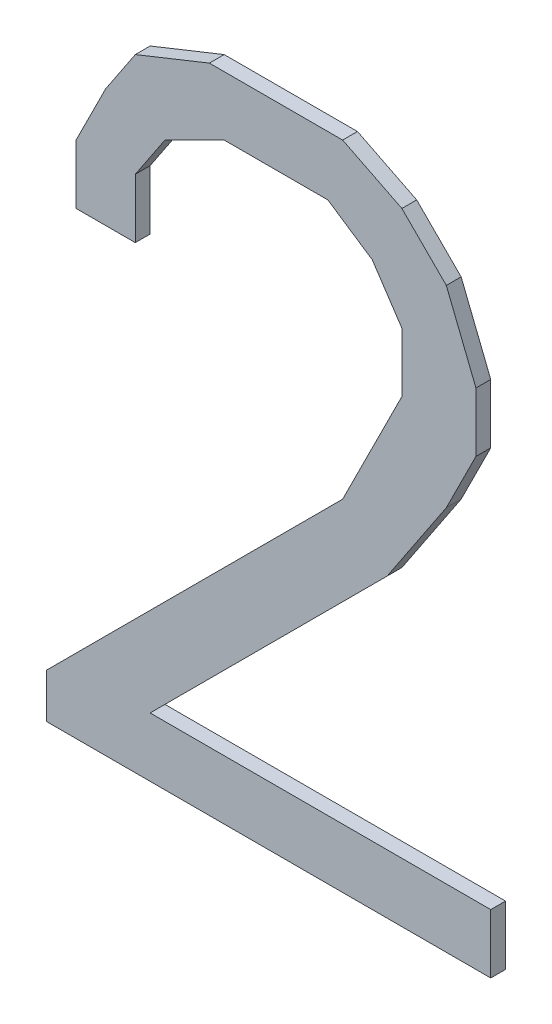
ISO-10303-21;
HEADER;
FILE_DESCRIPTION(('STEP AP214'),'2;1');
FILE_NAME('part.step','',(''),(''),'','','');
FILE_SCHEMA(('AUTOMOTIVE_DESIGN { 1 0 10303 214 1 1 1 1 }'));
ENDSEC;
DATA;
#1=APPLICATION_CONTEXT('core data for automotive mechanical design processes');
#2=APPLICATION_PROTOCOL_DEFINITION('international standard','automotive_design',2000,#1);
#3=PRODUCT_CONTEXT('',#1,'mechanical');
#4=PRODUCT('Part','Part','',(#3));
#5=PRODUCT_RELATED_PRODUCT_CATEGORY('part','',(#4));
#6=PRODUCT_DEFINITION_FORMATION('','',#4);
#7=PRODUCT_DEFINITION_CONTEXT('part definition',#1,'design');
#8=PRODUCT_DEFINITION('design','',#6,#7);
#9=PRODUCT_DEFINITION_SHAPE('','',#8);
#10=(LENGTH_UNIT() NAMED_UNIT(*) SI_UNIT(.MILLI.,.METRE.));
#11=(NAMED_UNIT(*) PLANE_ANGLE_UNIT() SI_UNIT($,.RADIAN.));
#12=(NAMED_UNIT(*) SI_UNIT($,.STERADIAN.) SOLID_ANGLE_UNIT());
#13=UNCERTAINTY_MEASURE_WITH_UNIT(LENGTH_MEASURE(1.E-05),#10,'distance_accuracy_value','');
#14=(GEOMETRIC_REPRESENTATION_CONTEXT(3) GLOBAL_UNCERTAINTY_ASSIGNED_CONTEXT((#13)) GLOBAL_UNIT_ASSIGNED_CONTEXT((#10,
#11,#12)) REPRESENTATION_CONTEXT('',''));
#15=CARTESIAN_POINT('',(0.,0.,0.));
#16=DIRECTION('',(0.,0.,1.));
#17=DIRECTION('',(1.,0.,0.));
#18=AXIS2_PLACEMENT_3D('',#15,#16,#17);
#19=CARTESIAN_POINT('',(-0.12999974,0.09000236,0.01));
#20=DIRECTION('',(0.,0.,1.));
#21=DIRECTION('',(1.,0.,0.));
#22=AXIS2_PLACEMENT_3D('',#19,#20,#21);
#23=PLANE('',#22);
#24=DIRECTION('',(-0.447213595499958,-0.894427190999916,0.));
#25=VECTOR('',#24,1.);
#26=CARTESIAN_POINT('',(-0.12999974,0.13000228,0.01));
#27=LINE('',#26,#25);
#28=CARTESIAN_POINT('',(-0.12999974,0.13000228,0.01));
#29=VERTEX_POINT('',#28);
#30=CARTESIAN_POINT('',(-0.10999978,0.1700022,0.01));
#31=VERTEX_POINT('',#30);
#32=EDGE_CURVE('E297',#29,#31,#27,.F.);
#33=ORIENTED_EDGE('',*,*,#32,.F.);
#34=DIRECTION('',(0.,1.,0.));
#35=VECTOR('',#34,1.);
#36=CARTESIAN_POINT('',(-0.12999974,0.09000236,0.01));
#37=LINE('',#36,#35);
#38=CARTESIAN_POINT('',(-0.12999974,0.09000236,0.01));
#39=VERTEX_POINT('',#38);
#40=EDGE_CURVE('E202',#39,#29,#37,.T.);
#41=ORIENTED_EDGE('',*,*,#40,.F.);
#42=DIRECTION('',(1.,0.,0.));
#43=VECTOR('',#42,1.);
#44=CARTESIAN_POINT('',(-0.08999982,0.09000236,0.01));
#45=LINE('',#44,#43);
#46=CARTESIAN_POINT('',(-0.08999982,0.09000236,0.01));
#47=VERTEX_POINT('',#46);
#48=EDGE_CURVE('E20',#47,#39,#45,.F.);
#49=ORIENTED_EDGE('',*,*,#48,.F.);
#50=DIRECTION('',(0.,1.,0.));
#51=VECTOR('',#50,1.);
#52=CARTESIAN_POINT('',(-0.08999982,0.13000228,0.01));
#53=LINE('',#52,#51);
#54=CARTESIAN_POINT('',(-0.0899998199999979,0.130002279999999,0.01));
#55=VERTEX_POINT('',#54);
#56=EDGE_CURVE('E191',#55,#47,#53,.F.);
#57=ORIENTED_EDGE('',*,*,#56,.F.);
#58=DIRECTION('',(0.554700196224998,0.832050294337997,0.));
#59=VECTOR('',#58,1.);
#60=CARTESIAN_POINT('',(-0.06999986,0.16000222,0.01));
#61=LINE('',#60,#59);
#62=CARTESIAN_POINT('',(-0.06999986,0.16000222,0.01));
#63=VERTEX_POINT('',#62);
#64=EDGE_CURVE('E186',#63,#55,#61,.F.);
#65=ORIENTED_EDGE('',*,*,#64,.F.);
#66=DIRECTION('',(0.894427190999916,0.447213595499958,0.));
#67=VECTOR('',#66,1.);
#68=CARTESIAN_POINT('',(-0.02999994,0.18000218,0.01));
#69=LINE('',#68,#67);
#70=CARTESIAN_POINT('',(-0.02999994,0.18000218,0.01));
#71=VERTEX_POINT('',#70);
#72=EDGE_CURVE('E213',#71,#63,#69,.F.);
#73=ORIENTED_EDGE('',*,*,#72,.F.);
#74=DIRECTION('',(1.,0.,0.));
#75=VECTOR('',#74,1.);
#76=CARTESIAN_POINT('',(0.03999992,0.18000218,0.01));
#77=LINE('',#76,#75);
#78=CARTESIAN_POINT('',(0.0399999199999987,0.180002179999998,0.01));
#79=VERTEX_POINT('',#78);
#80=EDGE_CURVE('E217',#79,#71,#77,.F.);
#81=ORIENTED_EDGE('',*,*,#80,.F.);
#82=DIRECTION('',(0.832050294337997,-0.554700196224998,0.));
#83=VECTOR('',#82,1.);
#84=CARTESIAN_POINT('',(0.06999986,0.16000222,0.01));
#85=LINE('',#84,#83);
#86=CARTESIAN_POINT('',(0.0699998600000021,0.160002220000001,0.01));
#87=VERTEX_POINT('',#86);
#88=EDGE_CURVE('E221',#87,#79,#85,.F.);
#89=ORIENTED_EDGE('',*,*,#88,.F.);
#90=DIRECTION('',(0.554700196224998,-0.832050294337997,0.));
#91=VECTOR('',#90,1.);
#92=CARTESIAN_POINT('',(0.08999982,0.13000228,0.01));
#93=LINE('',#92,#91);
#94=CARTESIAN_POINT('',(0.08999982,0.13000228,0.01));
#95=VERTEX_POINT('',#94);
#96=EDGE_CURVE('E225',#95,#87,#93,.F.);
#97=ORIENTED_EDGE('',*,*,#96,.F.);
#98=DIRECTION('',(0.,1.,0.));
#99=VECTOR('',#98,1.);
#100=CARTESIAN_POINT('',(0.08999982,0.09000236,0.01));
#101=LINE('',#100,#99);
#102=CARTESIAN_POINT('',(0.08999982,0.09000236,0.01));
#103=VERTEX_POINT('',#102);
#104=EDGE_CURVE('E229',#103,#95,#101,.T.);
#105=ORIENTED_EDGE('',*,*,#104,.F.);
#106=DIRECTION('',(-0.447213595499958,-0.894427190999916,0.));
#107=VECTOR('',#106,1.);
#108=CARTESIAN_POINT('',(0.0499999,0.01000252,0.01));
#109=LINE('',#108,#107);
#110=CARTESIAN_POINT('',(0.0499999000000021,0.0100025199999981,0.01));
#111=VERTEX_POINT('',#110);
#112=EDGE_CURVE('E233',#111,#103,#109,.F.);
#113=ORIENTED_EDGE('',*,*,#112,.F.);
#114=DIRECTION('',(-0.707102291063792,-0.707111271280792,0.));
#115=VECTOR('',#114,1.);
#116=CARTESIAN_POINT('',(-0.1499997,-0.18999962,0.01));
#117=LINE('',#116,#115);
#118=CARTESIAN_POINT('',(-0.1499997,-0.18999962,0.01));
#119=VERTEX_POINT('',#118);
#120=EDGE_CURVE('E237',#119,#111,#117,.F.);
#121=ORIENTED_EDGE('',*,*,#120,.F.);
#122=DIRECTION('',(0.,1.,0.));
#123=VECTOR('',#122,1.);
#124=CARTESIAN_POINT('',(-0.1499997,-0.21999956,0.01));
#125=LINE('',#124,#123);
#126=CARTESIAN_POINT('',(-0.1499997,-0.21999956,0.01));
#127=VERTEX_POINT('',#126);
#128=EDGE_CURVE('E241',#127,#119,#125,.T.);
#129=ORIENTED_EDGE('',*,*,#128,.F.);
#130=DIRECTION('',(1.,0.,0.));
#131=VECTOR('',#130,1.);
#132=CARTESIAN_POINT('',(0.15000224,-0.21999956,0.01));
#133=LINE('',#132,#131);
#134=CARTESIAN_POINT('',(0.15000224,-0.21999956,0.01));
#135=VERTEX_POINT('',#134);
#136=EDGE_CURVE('E245',#135,#127,#133,.F.);
#137=ORIENTED_EDGE('',*,*,#136,.F.);
#138=DIRECTION('',(0.,1.,0.));
#139=VECTOR('',#138,1.);
#140=CARTESIAN_POINT('',(0.15000224,-0.17999964,0.01));
#141=LINE('',#140,#139);
#142=CARTESIAN_POINT('',(0.15000224,-0.17999964,0.01));
#143=VERTEX_POINT('',#142);
#144=EDGE_CURVE('E249',#143,#135,#141,.F.);
#145=ORIENTED_EDGE('',*,*,#144,.F.);
#146=DIRECTION('',(1.,0.,0.));
#147=VECTOR('',#146,1.);
#148=CARTESIAN_POINT('',(-0.07999984,-0.17999964,0.01));
#149=LINE('',#148,#147);
#150=CARTESIAN_POINT('',(-0.0799998400000129,-0.179999639999987,0.01));
#151=VERTEX_POINT('',#150);
#152=EDGE_CURVE('E253',#151,#143,#149,.T.);
#153=ORIENTED_EDGE('',*,*,#152,.F.);
#154=DIRECTION('',(0.707101168537773,0.707112393790773,0.));
#155=VECTOR('',#154,1.);
#156=CARTESIAN_POINT('',(0.07999984,-0.01999742000001,0.01));
#157=LINE('',#156,#155);
#158=CARTESIAN_POINT('',(0.0799998400000031,-0.0199974200000119,0.01));
#159=VERTEX_POINT('',#158);
#160=EDGE_CURVE('E257',#159,#151,#157,.F.);
#161=ORIENTED_EDGE('',*,*,#160,.F.);
#162=DIRECTION('',(0.554700196224998,0.832050294337997,0.));
#163=VECTOR('',#162,1.);
#164=CARTESIAN_POINT('',(0.11999976,0.04000246,0.01));
#165=LINE('',#164,#163);
#166=CARTESIAN_POINT('',(0.11999976,0.040002459999999,0.01));
#167=VERTEX_POINT('',#166);
#168=EDGE_CURVE('E261',#167,#159,#165,.F.);
#169=ORIENTED_EDGE('',*,*,#168,.F.);
#170=DIRECTION('',(0.447259030760936,0.894404471926873,0.));
#171=VECTOR('',#170,1.);
#172=CARTESIAN_POINT('',(0.14000226,0.08000238,0.01));
#173=LINE('',#172,#171);
#174=CARTESIAN_POINT('',(0.14000226,0.08000238,0.01));
#175=VERTEX_POINT('',#174);
#176=EDGE_CURVE('E265',#175,#167,#173,.F.);
#177=ORIENTED_EDGE('',*,*,#176,.F.);
#178=DIRECTION('',(0.,1.,0.));
#179=VECTOR('',#178,1.);
#180=CARTESIAN_POINT('',(0.14000226,0.1200023,0.01));
#181=LINE('',#180,#179);
#182=CARTESIAN_POINT('',(0.140002260000003,0.120002300000001,0.01));
#183=VERTEX_POINT('',#182);
#184=EDGE_CURVE('E269',#183,#175,#181,.F.);
#185=ORIENTED_EDGE('',*,*,#184,.F.);
#186=DIRECTION('',(-0.371431336242982,0.928460425896954,0.));
#187=VECTOR('',#186,1.);
#188=CARTESIAN_POINT('',(0.11999976,0.1700022,0.01));
#189=LINE('',#188,#187);
#190=CARTESIAN_POINT('',(0.11999976,0.1700022,0.01));
#191=VERTEX_POINT('',#190);
#192=EDGE_CURVE('E273',#191,#183,#189,.F.);
#193=ORIENTED_EDGE('',*,*,#192,.F.);
#194=DIRECTION('',(-0.707106781186548,0.707106781186548,0.));
#195=VECTOR('',#194,1.);
#196=CARTESIAN_POINT('',(0.08999982,0.20000214,0.01));
#197=LINE('',#196,#195);
#198=CARTESIAN_POINT('',(0.08999982,0.20000214,0.01));
#199=VERTEX_POINT('',#198);
#200=EDGE_CURVE('E277',#199,#191,#197,.F.);
#201=ORIENTED_EDGE('',*,*,#200,.F.);
#202=DIRECTION('',(-0.894427190999916,0.447213595499958,0.));
#203=VECTOR('',#202,1.);
#204=CARTESIAN_POINT('',(0.0499999,0.2200021,0.01));
#205=LINE('',#204,#203);
#206=CARTESIAN_POINT('',(0.0499999,0.2200021,0.01));
#207=VERTEX_POINT('',#206);
#208=EDGE_CURVE('E281',#207,#199,#205,.F.);
#209=ORIENTED_EDGE('',*,*,#208,.F.);
#210=DIRECTION('',(1.,0.,0.));
#211=VECTOR('',#210,1.);
#212=CARTESIAN_POINT('',(-0.03999992,0.2200021,0.01));
#213=LINE('',#212,#211);
#214=CARTESIAN_POINT('',(-0.0399999199999999,0.2200021,0.01));
#215=VERTEX_POINT('',#214);
#216=EDGE_CURVE('E285',#215,#207,#213,.T.);
#217=ORIENTED_EDGE('',*,*,#216,.F.);
#218=DIRECTION('',(-0.928476690885259,-0.371390676354104,0.));
#219=VECTOR('',#218,1.);
#220=CARTESIAN_POINT('',(-0.08999982,0.20000214,0.01));
#221=LINE('',#220,#219);
#222=CARTESIAN_POINT('',(-0.0899998200000021,0.200002140000001,0.01));
#223=VERTEX_POINT('',#222);
#224=EDGE_CURVE('E289',#223,#215,#221,.F.);
#225=ORIENTED_EDGE('',*,*,#224,.F.);
#226=DIRECTION('',(-0.554700196224998,-0.832050294337997,0.));
#227=VECTOR('',#226,1.);
#228=CARTESIAN_POINT('',(-0.10999978,0.1700022,0.01));
#229=LINE('',#228,#227);
#230=EDGE_CURVE('E293',#31,#223,#229,.F.);
#231=ORIENTED_EDGE('',*,*,#230,.F.);
#232=EDGE_LOOP('',(#33,#41,#49,#57,#65,#73,#81,#89,#97,#105,#113,#121,#129,#137,#145,#153,#161,
#169,#177,#185,#193,#201,#209,#217,#225,#231));
#233=FACE_BOUND('',#232,.T.);
#234=ADVANCED_FACE('F17',(#233),#23,.T.);
#235=CARTESIAN_POINT('',(-0.08999982,0.09000236,0.));
#236=DIRECTION('',(0.,-1.,0.));
#237=DIRECTION('',(0.,0.,-1.));
#238=AXIS2_PLACEMENT_3D('',#235,#236,#237);
#239=PLANE('',#238);
#240=DIRECTION('',(0.,0.,1.));
#241=VECTOR('',#240,1.);
#242=CARTESIAN_POINT('',(-0.12999974,0.09000236,0.));
#243=LINE('',#242,#241);
#244=CARTESIAN_POINT('',(-0.12999974,0.09000236,0.));
#245=VERTEX_POINT('',#244);
#246=EDGE_CURVE('E301',#245,#39,#243,.T.);
#247=ORIENTED_EDGE('',*,*,#246,.F.);
#248=DIRECTION('',(1.,0.,0.));
#249=VECTOR('',#248,1.);
#250=CARTESIAN_POINT('',(-0.12999974,0.09000236,0.));
#251=LINE('',#250,#249);
#252=CARTESIAN_POINT('',(-0.08999982,0.09000236,0.));
#253=VERTEX_POINT('',#252);
#254=EDGE_CURVE('E208',#245,#253,#251,.T.);
#255=ORIENTED_EDGE('',*,*,#254,.T.);
#256=DIRECTION('',(0.,0.,-1.));
#257=VECTOR('',#256,1.);
#258=CARTESIAN_POINT('',(-0.08999982,0.09000236,0.));
#259=LINE('',#258,#257);
#260=EDGE_CURVE('E196',#47,#253,#259,.T.);
#261=ORIENTED_EDGE('',*,*,#260,.F.);
#262=ORIENTED_EDGE('',*,*,#48,.T.);
#263=EDGE_LOOP('',(#247,#255,#261,#262));
#264=FACE_BOUND('',#263,.T.);
#265=ADVANCED_FACE('F207',(#264),#239,.T.);
#266=CARTESIAN_POINT('',(-0.08999982,0.13000228,0.));
#267=DIRECTION('',(1.,0.,0.));
#268=DIRECTION('',(0.,0.,-1.));
#269=AXIS2_PLACEMENT_3D('',#266,#267,#268);
#270=PLANE('',#269);
#271=ORIENTED_EDGE('',*,*,#260,.T.);
#272=DIRECTION('',(0.,1.,0.));
#273=VECTOR('',#272,1.);
#274=CARTESIAN_POINT('',(-0.08999982,0.09000236,0.));
#275=LINE('',#274,#273);
#276=CARTESIAN_POINT('',(-0.0899998199999979,0.130002279999999,0.));
#277=VERTEX_POINT('',#276);
#278=EDGE_CURVE('E306',#253,#277,#275,.T.);
#279=ORIENTED_EDGE('',*,*,#278,.T.);
#280=DIRECTION('',(0.,0.,1.));
#281=VECTOR('',#280,1.);
#282=CARTESIAN_POINT('',(-0.0899998199999917,0.130002279999994,0.));
#283=LINE('',#282,#281);
#284=EDGE_CURVE('E198',#55,#277,#283,.F.);
#285=ORIENTED_EDGE('',*,*,#284,.F.);
#286=ORIENTED_EDGE('',*,*,#56,.T.);
#287=EDGE_LOOP('',(#271,#279,#285,#286));
#288=FACE_BOUND('',#287,.T.);
#289=ADVANCED_FACE('F193',(#288),#270,.T.);
#290=CARTESIAN_POINT('',(-0.06999986,0.16000222,0.));
#291=DIRECTION('',(0.832050294337997,-0.554700196224998,0.));
#292=DIRECTION('',(0.554700196224998,0.832050294337997,0.));
#293=AXIS2_PLACEMENT_3D('',#290,#291,#292);
#294=PLANE('',#293);
#295=ORIENTED_EDGE('',*,*,#284,.T.);
#296=DIRECTION('',(0.554700196225229,0.832050294337844,0.));
#297=VECTOR('',#296,1.);
#298=CARTESIAN_POINT('',(-0.08999982,0.13000228,0.));
#299=LINE('',#298,#297);
#300=CARTESIAN_POINT('',(-0.06999986,0.16000222,0.));
#301=VERTEX_POINT('',#300);
#302=EDGE_CURVE('E308',#277,#301,#299,.T.);
#303=ORIENTED_EDGE('',*,*,#302,.T.);
#304=DIRECTION('',(0.,0.,1.));
#305=VECTOR('',#304,1.);
#306=CARTESIAN_POINT('',(-0.06999986,0.16000222,0.));
#307=LINE('',#306,#305);
#308=EDGE_CURVE('E215',#63,#301,#307,.F.);
#309=ORIENTED_EDGE('',*,*,#308,.F.);
#310=ORIENTED_EDGE('',*,*,#64,.T.);
#311=EDGE_LOOP('',(#295,#303,#309,#310));
#312=FACE_BOUND('',#311,.T.);
#313=ADVANCED_FACE('F486',(#312),#294,.T.);
#314=CARTESIAN_POINT('',(-0.02999994,0.18000218,0.));
#315=DIRECTION('',(0.447213595499958,-0.894427190999916,0.));
#316=DIRECTION('',(0.894427190999916,0.447213595499958,0.));
#317=AXIS2_PLACEMENT_3D('',#314,#315,#316);
#318=PLANE('',#317);
#319=ORIENTED_EDGE('',*,*,#308,.T.);
#320=DIRECTION('',(0.894427190999916,0.447213595499958,0.));
#321=VECTOR('',#320,1.);
#322=CARTESIAN_POINT('',(-0.06999986,0.16000222,0.));
#323=LINE('',#322,#321);
#324=CARTESIAN_POINT('',(-0.02999994,0.18000218,0.));
#325=VERTEX_POINT('',#324);
#326=EDGE_CURVE('E311',#301,#325,#323,.T.);
#327=ORIENTED_EDGE('',*,*,#326,.T.);
#328=DIRECTION('',(0.,0.,-1.));
#329=VECTOR('',#328,1.);
#330=CARTESIAN_POINT('',(-0.02999994,0.18000218,0.));
#331=LINE('',#330,#329);
#332=EDGE_CURVE('E219',#71,#325,#331,.T.);
#333=ORIENTED_EDGE('',*,*,#332,.F.);
#334=ORIENTED_EDGE('',*,*,#72,.T.);
#335=EDGE_LOOP('',(#319,#327,#333,#334));
#336=FACE_BOUND('',#335,.T.);
#337=ADVANCED_FACE('F485',(#336),#318,.T.);
#338=CARTESIAN_POINT('',(0.03999992,0.18000218,0.));
#339=DIRECTION('',(0.,-1.,0.));
#340=DIRECTION('',(0.,0.,-1.));
#341=AXIS2_PLACEMENT_3D('',#338,#339,#340);
#342=PLANE('',#341);
#343=ORIENTED_EDGE('',*,*,#332,.T.);
#344=DIRECTION('',(1.,0.,0.));
#345=VECTOR('',#344,1.);
#346=CARTESIAN_POINT('',(-0.12999974,0.18000218,0.));
#347=LINE('',#346,#345);
#348=CARTESIAN_POINT('',(0.0399999199999986,0.180002179999998,0.));
#349=VERTEX_POINT('',#348);
#350=EDGE_CURVE('E314',#325,#349,#347,.T.);
#351=ORIENTED_EDGE('',*,*,#350,.T.);
#352=DIRECTION('',(0.,0.,1.));
#353=VECTOR('',#352,1.);
#354=CARTESIAN_POINT('',(0.0399999199999945,0.180002179999992,0.));
#355=LINE('',#354,#353);
#356=EDGE_CURVE('E223',#79,#349,#355,.F.);
#357=ORIENTED_EDGE('',*,*,#356,.F.);
#358=ORIENTED_EDGE('',*,*,#80,.T.);
#359=EDGE_LOOP('',(#343,#351,#357,#358));
#360=FACE_BOUND('',#359,.T.);
#361=ADVANCED_FACE('F479',(#360),#342,.T.);
#362=CARTESIAN_POINT('',(0.06999986,0.16000222,0.));
#363=DIRECTION('',(-0.554700196224998,-0.832050294337997,0.));
#364=DIRECTION('',(0.832050294337997,-0.554700196224998,0.));
#365=AXIS2_PLACEMENT_3D('',#362,#363,#364);
#366=PLANE('',#365);
#367=ORIENTED_EDGE('',*,*,#356,.T.);
#368=DIRECTION('',(0.832050294337843,-0.55470019622523,0.));
#369=VECTOR('',#368,1.);
#370=CARTESIAN_POINT('',(0.03999992,0.18000218,0.));
#371=LINE('',#370,#369);
#372=CARTESIAN_POINT('',(0.0699998600000021,0.160002220000001,0.));
#373=VERTEX_POINT('',#372);
#374=EDGE_CURVE('E317',#349,#373,#371,.T.);
#375=ORIENTED_EDGE('',*,*,#374,.T.);
#376=DIRECTION('',(0.,0.,1.));
#377=VECTOR('',#376,1.);
#378=CARTESIAN_POINT('',(0.0699998600000083,0.160002220000006,0.));
#379=LINE('',#378,#377);
#380=EDGE_CURVE('E227',#87,#373,#379,.F.);
#381=ORIENTED_EDGE('',*,*,#380,.F.);
#382=ORIENTED_EDGE('',*,*,#88,.T.);
#383=EDGE_LOOP('',(#367,#375,#381,#382));
#384=FACE_BOUND('',#383,.T.);
#385=ADVANCED_FACE('F475',(#384),#366,.T.);
#386=CARTESIAN_POINT('',(0.08999982,0.13000228,0.));
#387=DIRECTION('',(-0.832050294337997,-0.554700196224998,0.));
#388=DIRECTION('',(0.554700196224998,-0.832050294337997,0.));
#389=AXIS2_PLACEMENT_3D('',#386,#387,#388);
#390=PLANE('',#389);
#391=ORIENTED_EDGE('',*,*,#380,.T.);
#392=DIRECTION('',(0.554700196225229,-0.832050294337844,0.));
#393=VECTOR('',#392,1.);
#394=CARTESIAN_POINT('',(0.06999986,0.16000222,0.));
#395=LINE('',#394,#393);
#396=CARTESIAN_POINT('',(0.08999982,0.13000228,0.));
#397=VERTEX_POINT('',#396);
#398=EDGE_CURVE('E320',#373,#397,#395,.T.);
#399=ORIENTED_EDGE('',*,*,#398,.T.);
#400=DIRECTION('',(0.,0.,1.));
#401=VECTOR('',#400,1.);
#402=CARTESIAN_POINT('',(0.08999982,0.13000228,0.));
#403=LINE('',#402,#401);
#404=EDGE_CURVE('E231',#95,#397,#403,.F.);
#405=ORIENTED_EDGE('',*,*,#404,.F.);
#406=ORIENTED_EDGE('',*,*,#96,.T.);
#407=EDGE_LOOP('',(#391,#399,#405,#406));
#408=FACE_BOUND('',#407,.T.);
#409=ADVANCED_FACE('F469',(#408),#390,.T.);
#410=CARTESIAN_POINT('',(0.08999982,0.09000236,0.));
#411=DIRECTION('',(-1.,0.,0.));
#412=DIRECTION('',(0.,0.,1.));
#413=AXIS2_PLACEMENT_3D('',#410,#411,#412);
#414=PLANE('',#413);
#415=ORIENTED_EDGE('',*,*,#404,.T.);
#416=DIRECTION('',(0.,1.,0.));
#417=VECTOR('',#416,1.);
#418=CARTESIAN_POINT('',(0.08999982,0.09000236,0.));
#419=LINE('',#418,#417);
#420=CARTESIAN_POINT('',(0.08999982,0.09000236,0.));
#421=VERTEX_POINT('',#420);
#422=EDGE_CURVE('E323',#397,#421,#419,.F.);
#423=ORIENTED_EDGE('',*,*,#422,.T.);
#424=DIRECTION('',(0.,0.,1.));
#425=VECTOR('',#424,1.);
#426=CARTESIAN_POINT('',(0.08999982,0.09000236,0.));
#427=LINE('',#426,#425);
#428=EDGE_CURVE('E235',#103,#421,#427,.F.);
#429=ORIENTED_EDGE('',*,*,#428,.F.);
#430=ORIENTED_EDGE('',*,*,#104,.T.);
#431=EDGE_LOOP('',(#415,#423,#429,#430));
#432=FACE_BOUND('',#431,.T.);
#433=ADVANCED_FACE('F465',(#432),#414,.T.);
#434=CARTESIAN_POINT('',(0.0499999,0.01000252,0.));
#435=DIRECTION('',(-0.894427190999916,0.447213595499958,0.));
#436=DIRECTION('',(-0.447213595499958,-0.894427190999916,0.));
#437=AXIS2_PLACEMENT_3D('',#434,#435,#436);
#438=PLANE('',#437);
#439=ORIENTED_EDGE('',*,*,#428,.T.);
#440=DIRECTION('',(-0.447213595499958,-0.894427190999916,0.));
#441=VECTOR('',#440,1.);
#442=CARTESIAN_POINT('',(0.08999982,0.09000236,0.));
#443=LINE('',#442,#441);
#444=CARTESIAN_POINT('',(0.049999900000002,0.010002519999998,0.));
#445=VERTEX_POINT('',#444);
#446=EDGE_CURVE('E326',#421,#445,#443,.T.);
#447=ORIENTED_EDGE('',*,*,#446,.T.);
#448=DIRECTION('',(0.,0.,1.));
#449=VECTOR('',#448,1.);
#450=CARTESIAN_POINT('',(0.0499999000000081,0.010002519999992,0.));
#451=LINE('',#450,#449);
#452=EDGE_CURVE('E239',#111,#445,#451,.F.);
#453=ORIENTED_EDGE('',*,*,#452,.F.);
#454=ORIENTED_EDGE('',*,*,#112,.T.);
#455=EDGE_LOOP('',(#439,#447,#453,#454));
#456=FACE_BOUND('',#455,.T.);
#457=ADVANCED_FACE('F459',(#456),#438,.T.);
#458=CARTESIAN_POINT('',(-0.1499997,-0.18999962,0.));
#459=DIRECTION('',(-0.707111271280792,0.707102291063792,0.));
#460=DIRECTION('',(-0.707102291063792,-0.707111271280792,0.));
#461=AXIS2_PLACEMENT_3D('',#458,#459,#460);
#462=PLANE('',#461);
#463=ORIENTED_EDGE('',*,*,#452,.T.);
#464=DIRECTION('',(-0.707102291063763,-0.70711127128082,0.));
#465=VECTOR('',#464,1.);
#466=CARTESIAN_POINT('',(0.0499999,0.01000252,0.));
#467=LINE('',#466,#465);
#468=CARTESIAN_POINT('',(-0.1499997,-0.18999962,0.));
#469=VERTEX_POINT('',#468);
#470=EDGE_CURVE('E329',#445,#469,#467,.T.);
#471=ORIENTED_EDGE('',*,*,#470,.T.);
#472=DIRECTION('',(0.,0.,1.));
#473=VECTOR('',#472,1.);
#474=CARTESIAN_POINT('',(-0.1499997,-0.18999962,0.));
#475=LINE('',#474,#473);
#476=EDGE_CURVE('E243',#119,#469,#475,.F.);
#477=ORIENTED_EDGE('',*,*,#476,.F.);
#478=ORIENTED_EDGE('',*,*,#120,.T.);
#479=EDGE_LOOP('',(#463,#471,#477,#478));
#480=FACE_BOUND('',#479,.T.);
#481=ADVANCED_FACE('F455',(#480),#462,.T.);
#482=CARTESIAN_POINT('',(-0.1499997,-0.21999956,0.));
#483=DIRECTION('',(-1.,0.,0.));
#484=DIRECTION('',(0.,0.,1.));
#485=AXIS2_PLACEMENT_3D('',#482,#483,#484);
#486=PLANE('',#485);
#487=ORIENTED_EDGE('',*,*,#476,.T.);
#488=DIRECTION('',(0.,1.,0.));
#489=VECTOR('',#488,1.);
#490=CARTESIAN_POINT('',(-0.1499997,0.09000236,0.));
#491=LINE('',#490,#489);
#492=CARTESIAN_POINT('',(-0.1499997,-0.21999956,0.));
#493=VERTEX_POINT('',#492);
#494=EDGE_CURVE('E332',#469,#493,#491,.F.);
#495=ORIENTED_EDGE('',*,*,#494,.T.);
#496=DIRECTION('',(0.,0.,-1.));
#497=VECTOR('',#496,1.);
#498=CARTESIAN_POINT('',(-0.1499997,-0.21999956,0.));
#499=LINE('',#498,#497);
#500=EDGE_CURVE('E247',#127,#493,#499,.T.);
#501=ORIENTED_EDGE('',*,*,#500,.F.);
#502=ORIENTED_EDGE('',*,*,#128,.T.);
#503=EDGE_LOOP('',(#487,#495,#501,#502));
#504=FACE_BOUND('',#503,.T.);
#505=ADVANCED_FACE('F449',(#504),#486,.T.);
#506=CARTESIAN_POINT('',(0.15000224,-0.21999956,0.));
#507=DIRECTION('',(0.,-1.,0.));
#508=DIRECTION('',(0.,0.,-1.));
#509=AXIS2_PLACEMENT_3D('',#506,#507,#508);
#510=PLANE('',#509);
#511=ORIENTED_EDGE('',*,*,#500,.T.);
#512=DIRECTION('',(1.,0.,0.));
#513=VECTOR('',#512,1.);
#514=CARTESIAN_POINT('',(-0.12999974,-0.21999956,0.));
#515=LINE('',#514,#513);
#516=CARTESIAN_POINT('',(0.15000224,-0.21999956,0.));
#517=VERTEX_POINT('',#516);
#518=EDGE_CURVE('E335',#493,#517,#515,.T.);
#519=ORIENTED_EDGE('',*,*,#518,.T.);
#520=DIRECTION('',(0.,0.,-1.));
#521=VECTOR('',#520,1.);
#522=CARTESIAN_POINT('',(0.15000224,-0.21999956,0.));
#523=LINE('',#522,#521);
#524=EDGE_CURVE('E251',#135,#517,#523,.T.);
#525=ORIENTED_EDGE('',*,*,#524,.F.);
#526=ORIENTED_EDGE('',*,*,#136,.T.);
#527=EDGE_LOOP('',(#511,#519,#525,#526));
#528=FACE_BOUND('',#527,.T.);
#529=ADVANCED_FACE('F445',(#528),#510,.T.);
#530=CARTESIAN_POINT('',(0.15000224,-0.17999964,0.));
#531=DIRECTION('',(1.,0.,0.));
#532=DIRECTION('',(0.,0.,-1.));
#533=AXIS2_PLACEMENT_3D('',#530,#531,#532);
#534=PLANE('',#533);
#535=ORIENTED_EDGE('',*,*,#524,.T.);
#536=DIRECTION('',(0.,1.,0.));
#537=VECTOR('',#536,1.);
#538=CARTESIAN_POINT('',(0.15000224,0.09000236,0.));
#539=LINE('',#538,#537);
#540=CARTESIAN_POINT('',(0.15000224,-0.17999964,0.));
#541=VERTEX_POINT('',#540);
#542=EDGE_CURVE('E338',#517,#541,#539,.T.);
#543=ORIENTED_EDGE('',*,*,#542,.T.);
#544=DIRECTION('',(0.,0.,1.));
#545=VECTOR('',#544,1.);
#546=CARTESIAN_POINT('',(0.15000224,-0.17999964,0.));
#547=LINE('',#546,#545);
#548=EDGE_CURVE('E255',#143,#541,#547,.F.);
#549=ORIENTED_EDGE('',*,*,#548,.F.);
#550=ORIENTED_EDGE('',*,*,#144,.T.);
#551=EDGE_LOOP('',(#535,#543,#549,#550));
#552=FACE_BOUND('',#551,.T.);
#553=ADVANCED_FACE('F439',(#552),#534,.T.);
#554=CARTESIAN_POINT('',(-0.07999984,-0.17999964,0.));
#555=DIRECTION('',(0.,1.,0.));
#556=DIRECTION('',(0.,0.,1.));
#557=AXIS2_PLACEMENT_3D('',#554,#555,#556);
#558=PLANE('',#557);
#559=ORIENTED_EDGE('',*,*,#548,.T.);
#560=DIRECTION('',(1.,0.,0.));
#561=VECTOR('',#560,1.);
#562=CARTESIAN_POINT('',(-0.12999974,-0.17999964,0.));
#563=LINE('',#562,#561);
#564=CARTESIAN_POINT('',(-0.0799998400000129,-0.179999639999987,0.));
#565=VERTEX_POINT('',#564);
#566=EDGE_CURVE('E341',#541,#565,#563,.F.);
#567=ORIENTED_EDGE('',*,*,#566,.T.);
#568=DIRECTION('',(0.,0.,1.));
#569=VECTOR('',#568,1.);
#570=CARTESIAN_POINT('',(-0.0799998400000517,-0.179999639999948,0.));
#571=LINE('',#570,#569);
#572=EDGE_CURVE('E259',#151,#565,#571,.F.);
#573=ORIENTED_EDGE('',*,*,#572,.F.);
#574=ORIENTED_EDGE('',*,*,#152,.T.);
#575=EDGE_LOOP('',(#559,#567,#573,#574));
#576=FACE_BOUND('',#575,.T.);
#577=ADVANCED_FACE('F435',(#576),#558,.T.);
#578=CARTESIAN_POINT('',(0.07999984,-0.01999742000001,0.));
#579=DIRECTION('',(0.707112393790773,-0.707101168537773,0.));
#580=DIRECTION('',(0.707101168537773,0.707112393790773,0.));
#581=AXIS2_PLACEMENT_3D('',#578,#579,#580);
#582=PLANE('',#581);
#583=ORIENTED_EDGE('',*,*,#572,.T.);
#584=DIRECTION('',(0.707101168537544,0.707112393791001,0.));
#585=VECTOR('',#584,1.);
#586=CARTESIAN_POINT('',(-0.07999984,-0.17999964,0.));
#587=LINE('',#586,#585);
#588=CARTESIAN_POINT('',(0.0799998400000031,-0.0199974200000119,0.));
#589=VERTEX_POINT('',#588);
#590=EDGE_CURVE('E344',#565,#589,#587,.T.);
#591=ORIENTED_EDGE('',*,*,#590,.T.);
#592=DIRECTION('',(0.,0.,1.));
#593=VECTOR('',#592,1.);
#594=CARTESIAN_POINT('',(0.079999840000012,-0.019997420000018,0.));
#595=LINE('',#594,#593);
#596=EDGE_CURVE('E263',#159,#589,#595,.F.);
#597=ORIENTED_EDGE('',*,*,#596,.F.);
#598=ORIENTED_EDGE('',*,*,#160,.T.);
#599=EDGE_LOOP('',(#583,#591,#597,#598));
#600=FACE_BOUND('',#599,.T.);
#601=ADVANCED_FACE('F429',(#600),#582,.T.);
#602=CARTESIAN_POINT('',(0.11999976,0.04000246,0.));
#603=DIRECTION('',(0.832050294337997,-0.554700196224998,0.));
#604=DIRECTION('',(0.554700196224998,0.832050294337997,0.));
#605=AXIS2_PLACEMENT_3D('',#602,#603,#604);
#606=PLANE('',#605);
#607=ORIENTED_EDGE('',*,*,#596,.T.);
#608=DIRECTION('',(0.554700196225165,0.832050294337886,0.));
#609=VECTOR('',#608,1.);
#610=CARTESIAN_POINT('',(0.07999984,-0.01999742000001,0.));
#611=LINE('',#610,#609);
#612=CARTESIAN_POINT('',(0.11999976,0.0400024599999994,0.));
#613=VERTEX_POINT('',#612);
#614=EDGE_CURVE('E347',#589,#613,#611,.T.);
#615=ORIENTED_EDGE('',*,*,#614,.T.);
#616=DIRECTION('',(0.,0.,1.));
#617=VECTOR('',#616,1.);
#618=CARTESIAN_POINT('',(0.119999760000002,0.040002459999999,0.));
#619=LINE('',#618,#617);
#620=EDGE_CURVE('E267',#167,#613,#619,.F.);
#621=ORIENTED_EDGE('',*,*,#620,.F.);
#622=ORIENTED_EDGE('',*,*,#168,.T.);
#623=EDGE_LOOP('',(#607,#615,#621,#622));
#624=FACE_BOUND('',#623,.T.);
#625=ADVANCED_FACE('F425',(#624),#606,.T.);
#626=CARTESIAN_POINT('',(0.14000226,0.08000238,0.));
#627=DIRECTION('',(0.894404471926873,-0.447259030760936,0.));
#628=DIRECTION('',(0.447259030760936,0.894404471926873,0.));
#629=AXIS2_PLACEMENT_3D('',#626,#627,#628);
#630=PLANE('',#629);
#631=ORIENTED_EDGE('',*,*,#620,.T.);
#632=DIRECTION('',(0.447259030760982,0.89440447192685,0.));
#633=VECTOR('',#632,1.);
#634=CARTESIAN_POINT('',(0.11999976,0.04000246,0.));
#635=LINE('',#634,#633);
#636=CARTESIAN_POINT('',(0.14000226,0.08000238,0.));
#637=VERTEX_POINT('',#636);
#638=EDGE_CURVE('E350',#613,#637,#635,.T.);
#639=ORIENTED_EDGE('',*,*,#638,.T.);
#640=DIRECTION('',(0.,0.,-1.));
#641=VECTOR('',#640,1.);
#642=CARTESIAN_POINT('',(0.14000226,0.08000238,0.));
#643=LINE('',#642,#641);
#644=EDGE_CURVE('E271',#175,#637,#643,.T.);
#645=ORIENTED_EDGE('',*,*,#644,.F.);
#646=ORIENTED_EDGE('',*,*,#176,.T.);
#647=EDGE_LOOP('',(#631,#639,#645,#646));
#648=FACE_BOUND('',#647,.T.);
#649=ADVANCED_FACE('F419',(#648),#630,.T.);
#650=CARTESIAN_POINT('',(0.14000226,0.1200023,0.));
#651=DIRECTION('',(1.,0.,0.));
#652=DIRECTION('',(0.,0.,-1.));
#653=AXIS2_PLACEMENT_3D('',#650,#651,#652);
#654=PLANE('',#653);
#655=ORIENTED_EDGE('',*,*,#644,.T.);
#656=DIRECTION('',(0.,1.,0.));
#657=VECTOR('',#656,1.);
#658=CARTESIAN_POINT('',(0.14000226,0.09000236,0.));
#659=LINE('',#658,#657);
#660=CARTESIAN_POINT('',(0.140002260000003,0.120002300000001,0.));
#661=VERTEX_POINT('',#660);
#662=EDGE_CURVE('E353',#637,#661,#659,.T.);
#663=ORIENTED_EDGE('',*,*,#662,.T.);
#664=DIRECTION('',(0.,0.,1.));
#665=VECTOR('',#664,1.);
#666=CARTESIAN_POINT('',(0.140002260000011,0.120002300000004,0.));
#667=LINE('',#666,#665);
#668=EDGE_CURVE('E275',#183,#661,#667,.F.);
#669=ORIENTED_EDGE('',*,*,#668,.F.);
#670=ORIENTED_EDGE('',*,*,#184,.T.);
#671=EDGE_LOOP('',(#655,#663,#669,#670));
#672=FACE_BOUND('',#671,.T.);
#673=ADVANCED_FACE('F415',(#672),#654,.T.);
#674=CARTESIAN_POINT('',(0.11999976,0.1700022,0.));
#675=DIRECTION('',(0.928460425896954,0.371431336242982,0.));
#676=DIRECTION('',(-0.371431336242982,0.928460425896954,0.));
#677=AXIS2_PLACEMENT_3D('',#674,#675,#676);
#678=PLANE('',#677);
#679=ORIENTED_EDGE('',*,*,#668,.T.);
#680=DIRECTION('',(-0.371431336242781,0.928460425897034,0.));
#681=VECTOR('',#680,1.);
#682=CARTESIAN_POINT('',(0.14000226,0.1200023,0.));
#683=LINE('',#682,#681);
#684=CARTESIAN_POINT('',(0.11999976,0.1700022,0.));
#685=VERTEX_POINT('',#684);
#686=EDGE_CURVE('E356',#661,#685,#683,.T.);
#687=ORIENTED_EDGE('',*,*,#686,.T.);
#688=DIRECTION('',(0.,0.,1.));
#689=VECTOR('',#688,1.);
#690=CARTESIAN_POINT('',(0.11999976,0.1700022,0.));
#691=LINE('',#690,#689);
#692=EDGE_CURVE('E279',#191,#685,#691,.F.);
#693=ORIENTED_EDGE('',*,*,#692,.F.);
#694=ORIENTED_EDGE('',*,*,#192,.T.);
#695=EDGE_LOOP('',(#679,#687,#693,#694));
#696=FACE_BOUND('',#695,.T.);
#697=ADVANCED_FACE('F409',(#696),#678,.T.);
#698=CARTESIAN_POINT('',(0.08999982,0.20000214,0.));
#699=DIRECTION('',(0.707106781186548,0.707106781186548,0.));
#700=DIRECTION('',(-0.707106781186548,0.707106781186548,0.));
#701=AXIS2_PLACEMENT_3D('',#698,#699,#700);
#702=PLANE('',#701);
#703=ORIENTED_EDGE('',*,*,#692,.T.);
#704=DIRECTION('',(-0.707106781186547,0.707106781186547,0.));
#705=VECTOR('',#704,1.);
#706=CARTESIAN_POINT('',(0.11999976,0.1700022,0.));
#707=LINE('',#706,#705);
#708=CARTESIAN_POINT('',(0.08999982,0.20000214,0.));
#709=VERTEX_POINT('',#708);
#710=EDGE_CURVE('E359',#685,#709,#707,.T.);
#711=ORIENTED_EDGE('',*,*,#710,.T.);
#712=DIRECTION('',(0.,0.,1.));
#713=VECTOR('',#712,1.);
#714=CARTESIAN_POINT('',(0.08999982,0.20000214,0.));
#715=LINE('',#714,#713);
#716=EDGE_CURVE('E283',#199,#709,#715,.F.);
#717=ORIENTED_EDGE('',*,*,#716,.F.);
#718=ORIENTED_EDGE('',*,*,#200,.T.);
#719=EDGE_LOOP('',(#703,#711,#717,#718));
#720=FACE_BOUND('',#719,.T.);
#721=ADVANCED_FACE('F405',(#720),#702,.T.);
#722=CARTESIAN_POINT('',(0.0499999,0.2200021,0.));
#723=DIRECTION('',(0.447213595499958,0.894427190999916,0.));
#724=DIRECTION('',(-0.894427190999916,0.447213595499958,0.));
#725=AXIS2_PLACEMENT_3D('',#722,#723,#724);
#726=PLANE('',#725);
#727=ORIENTED_EDGE('',*,*,#716,.T.);
#728=DIRECTION('',(-0.894427190999915,0.447213595499959,0.));
#729=VECTOR('',#728,1.);
#730=CARTESIAN_POINT('',(0.08999982,0.20000214,0.));
#731=LINE('',#730,#729);
#732=CARTESIAN_POINT('',(0.0499999,0.2200021,0.));
#733=VERTEX_POINT('',#732);
#734=EDGE_CURVE('E362',#709,#733,#731,.T.);
#735=ORIENTED_EDGE('',*,*,#734,.T.);
#736=DIRECTION('',(0.,0.,1.));
#737=VECTOR('',#736,1.);
#738=CARTESIAN_POINT('',(0.0499999,0.2200021,0.));
#739=LINE('',#738,#737);
#740=EDGE_CURVE('E287',#207,#733,#739,.F.);
#741=ORIENTED_EDGE('',*,*,#740,.F.);
#742=ORIENTED_EDGE('',*,*,#208,.T.);
#743=EDGE_LOOP('',(#727,#735,#741,#742));
#744=FACE_BOUND('',#743,.T.);
#745=ADVANCED_FACE('F399',(#744),#726,.T.);
#746=CARTESIAN_POINT('',(-0.03999992,0.2200021,0.));
#747=DIRECTION('',(0.,1.,0.));
#748=DIRECTION('',(0.,0.,1.));
#749=AXIS2_PLACEMENT_3D('',#746,#747,#748);
#750=PLANE('',#749);
#751=ORIENTED_EDGE('',*,*,#740,.T.);
#752=DIRECTION('',(1.,0.,0.));
#753=VECTOR('',#752,1.);
#754=CARTESIAN_POINT('',(-0.12999974,0.2200021,0.));
#755=LINE('',#754,#753);
#756=CARTESIAN_POINT('',(-0.03999992,0.2200021,0.));
#757=VERTEX_POINT('',#756);
#758=EDGE_CURVE('E365',#733,#757,#755,.F.);
#759=ORIENTED_EDGE('',*,*,#758,.T.);
#760=DIRECTION('',(0.,0.,1.));
#761=VECTOR('',#760,1.);
#762=CARTESIAN_POINT('',(-0.03999992,0.2200021,0.));
#763=LINE('',#762,#761);
#764=EDGE_CURVE('E291',#215,#757,#763,.F.);
#765=ORIENTED_EDGE('',*,*,#764,.F.);
#766=ORIENTED_EDGE('',*,*,#216,.T.);
#767=EDGE_LOOP('',(#751,#759,#765,#766));
#768=FACE_BOUND('',#767,.T.);
#769=ADVANCED_FACE('F395',(#768),#750,.T.);
#770=CARTESIAN_POINT('',(-0.08999982,0.20000214,0.));
#771=DIRECTION('',(-0.371390676354104,0.928476690885259,0.));
#772=DIRECTION('',(-0.928476690885259,-0.371390676354104,0.));
#773=AXIS2_PLACEMENT_3D('',#770,#771,#772);
#774=PLANE('',#773);
#775=ORIENTED_EDGE('',*,*,#764,.T.);
#776=DIRECTION('',(-0.928476690885259,-0.371390676354105,0.));
#777=VECTOR('',#776,1.);
#778=CARTESIAN_POINT('',(-0.03999992,0.2200021,0.));
#779=LINE('',#778,#777);
#780=CARTESIAN_POINT('',(-0.0899998200000021,0.200002140000001,0.));
#781=VERTEX_POINT('',#780);
#782=EDGE_CURVE('E368',#757,#781,#779,.T.);
#783=ORIENTED_EDGE('',*,*,#782,.T.);
#784=DIRECTION('',(0.,0.,1.));
#785=VECTOR('',#784,1.);
#786=CARTESIAN_POINT('',(-0.0899998200000083,0.200002140000006,0.));
#787=LINE('',#786,#785);
#788=EDGE_CURVE('E295',#223,#781,#787,.F.);
#789=ORIENTED_EDGE('',*,*,#788,.F.);
#790=ORIENTED_EDGE('',*,*,#224,.T.);
#791=EDGE_LOOP('',(#775,#783,#789,#790));
#792=FACE_BOUND('',#791,.T.);
#793=ADVANCED_FACE('F389',(#792),#774,.T.);
#794=CARTESIAN_POINT('',(-0.10999978,0.1700022,0.));
#795=DIRECTION('',(-0.832050294337997,0.554700196224998,0.));
#796=DIRECTION('',(-0.554700196224998,-0.832050294337997,0.));
#797=AXIS2_PLACEMENT_3D('',#794,#795,#796);
#798=PLANE('',#797);
#799=ORIENTED_EDGE('',*,*,#788,.T.);
#800=DIRECTION('',(-0.554700196225229,-0.832050294337843,0.));
#801=VECTOR('',#800,1.);
#802=CARTESIAN_POINT('',(-0.08999982,0.20000214,0.));
#803=LINE('',#802,#801);
#804=CARTESIAN_POINT('',(-0.10999978,0.1700022,0.));
#805=VERTEX_POINT('',#804);
#806=EDGE_CURVE('E371',#781,#805,#803,.T.);
#807=ORIENTED_EDGE('',*,*,#806,.T.);
#808=DIRECTION('',(0.,0.,1.));
#809=VECTOR('',#808,1.);
#810=CARTESIAN_POINT('',(-0.10999978,0.1700022,0.));
#811=LINE('',#810,#809);
#812=EDGE_CURVE('E299',#31,#805,#811,.F.);
#813=ORIENTED_EDGE('',*,*,#812,.F.);
#814=ORIENTED_EDGE('',*,*,#230,.T.);
#815=EDGE_LOOP('',(#799,#807,#813,#814));
#816=FACE_BOUND('',#815,.T.);
#817=ADVANCED_FACE('F384',(#816),#798,.T.);
#818=CARTESIAN_POINT('',(-0.12999974,0.13000228,0.));
#819=DIRECTION('',(-0.894427190999916,0.447213595499958,0.));
#820=DIRECTION('',(-0.447213595499958,-0.894427190999916,0.));
#821=AXIS2_PLACEMENT_3D('',#818,#819,#820);
#822=PLANE('',#821);
#823=ORIENTED_EDGE('',*,*,#812,.T.);
#824=DIRECTION('',(-0.447213595499958,-0.894427190999916,0.));
#825=VECTOR('',#824,1.);
#826=CARTESIAN_POINT('',(-0.10999978,0.1700022,0.));
#827=LINE('',#826,#825);
#828=CARTESIAN_POINT('',(-0.12999974,0.13000228,0.));
#829=VERTEX_POINT('',#828);
#830=EDGE_CURVE('E26',#805,#829,#827,.T.);
#831=ORIENTED_EDGE('',*,*,#830,.T.);
#832=DIRECTION('',(0.,0.,1.));
#833=VECTOR('',#832,1.);
#834=CARTESIAN_POINT('',(-0.12999974,0.13000228,0.));
#835=LINE('',#834,#833);
#836=EDGE_CURVE('E34',#29,#829,#835,.F.);
#837=ORIENTED_EDGE('',*,*,#836,.F.);
#838=ORIENTED_EDGE('',*,*,#32,.T.);
#839=EDGE_LOOP('',(#823,#831,#837,#838));
#840=FACE_BOUND('',#839,.T.);
#841=ADVANCED_FACE('F377',(#840),#822,.T.);
#842=CARTESIAN_POINT('',(-0.12999974,0.09000236,0.));
#843=DIRECTION('',(-1.,0.,0.));
#844=DIRECTION('',(0.,0.,1.));
#845=AXIS2_PLACEMENT_3D('',#842,#843,#844);
#846=PLANE('',#845);
#847=ORIENTED_EDGE('',*,*,#836,.T.);
#848=DIRECTION('',(0.,1.,0.));
#849=VECTOR('',#848,1.);
#850=CARTESIAN_POINT('',(-0.12999974,0.09000236,0.));
#851=LINE('',#850,#849);
#852=EDGE_CURVE('E11',#829,#245,#851,.F.);
#853=ORIENTED_EDGE('',*,*,#852,.T.);
#854=ORIENTED_EDGE('',*,*,#246,.T.);
#855=ORIENTED_EDGE('',*,*,#40,.T.);
#856=EDGE_LOOP('',(#847,#853,#854,#855));
#857=FACE_BOUND('',#856,.T.);
#858=ADVANCED_FACE('F487',(#857),#846,.T.);
#859=CARTESIAN_POINT('',(-0.12999974,0.09000236,0.));
#860=DIRECTION('',(0.,0.,1.));
#861=DIRECTION('',(1.,0.,0.));
#862=AXIS2_PLACEMENT_3D('',#859,#860,#861);
#863=PLANE('',#862);
#864=ORIENTED_EDGE('',*,*,#830,.F.);
#865=ORIENTED_EDGE('',*,*,#806,.F.);
#866=ORIENTED_EDGE('',*,*,#782,.F.);
#867=ORIENTED_EDGE('',*,*,#758,.F.);
#868=ORIENTED_EDGE('',*,*,#734,.F.);
#869=ORIENTED_EDGE('',*,*,#710,.F.);
#870=ORIENTED_EDGE('',*,*,#686,.F.);
#871=ORIENTED_EDGE('',*,*,#662,.F.);
#872=ORIENTED_EDGE('',*,*,#638,.F.);
#873=ORIENTED_EDGE('',*,*,#614,.F.);
#874=ORIENTED_EDGE('',*,*,#590,.F.);
#875=ORIENTED_EDGE('',*,*,#566,.F.);
#876=ORIENTED_EDGE('',*,*,#542,.F.);
#877=ORIENTED_EDGE('',*,*,#518,.F.);
#878=ORIENTED_EDGE('',*,*,#494,.F.);
#879=ORIENTED_EDGE('',*,*,#470,.F.);
#880=ORIENTED_EDGE('',*,*,#446,.F.);
#881=ORIENTED_EDGE('',*,*,#422,.F.);
#882=ORIENTED_EDGE('',*,*,#398,.F.);
#883=ORIENTED_EDGE('',*,*,#374,.F.);
#884=ORIENTED_EDGE('',*,*,#350,.F.);
#885=ORIENTED_EDGE('',*,*,#326,.F.);
#886=ORIENTED_EDGE('',*,*,#302,.F.);
#887=ORIENTED_EDGE('',*,*,#278,.F.);
#888=ORIENTED_EDGE('',*,*,#254,.F.);
#889=ORIENTED_EDGE('',*,*,#852,.F.);
#890=EDGE_LOOP('',(#864,#865,#866,#867,#868,#869,#870,#871,#872,#873,#874,#875,#876,#877,#878,
#879,#880,#881,#882,#883,#884,#885,#886,#887,#888,#889));
#891=FACE_BOUND('',#890,.T.);
#892=ADVANCED_FACE('F381',(#891),#863,.F.);
#893=CLOSED_SHELL('',(#234,#265,#289,#313,#337,#361,#385,#409,#433,#457,#481,#505,#529,#553,
#577,#601,#625,#649,#673,#697,#721,#745,#769,#793,#817,#841,#858,#892));
#894=MANIFOLD_SOLID_BREP('B1',#893);
#895=ADVANCED_BREP_SHAPE_REPRESENTATION('',(#18,#894),#14);
#896=SHAPE_DEFINITION_REPRESENTATION(#9,#895);
ENDSEC;
END-ISO-10303-21;
